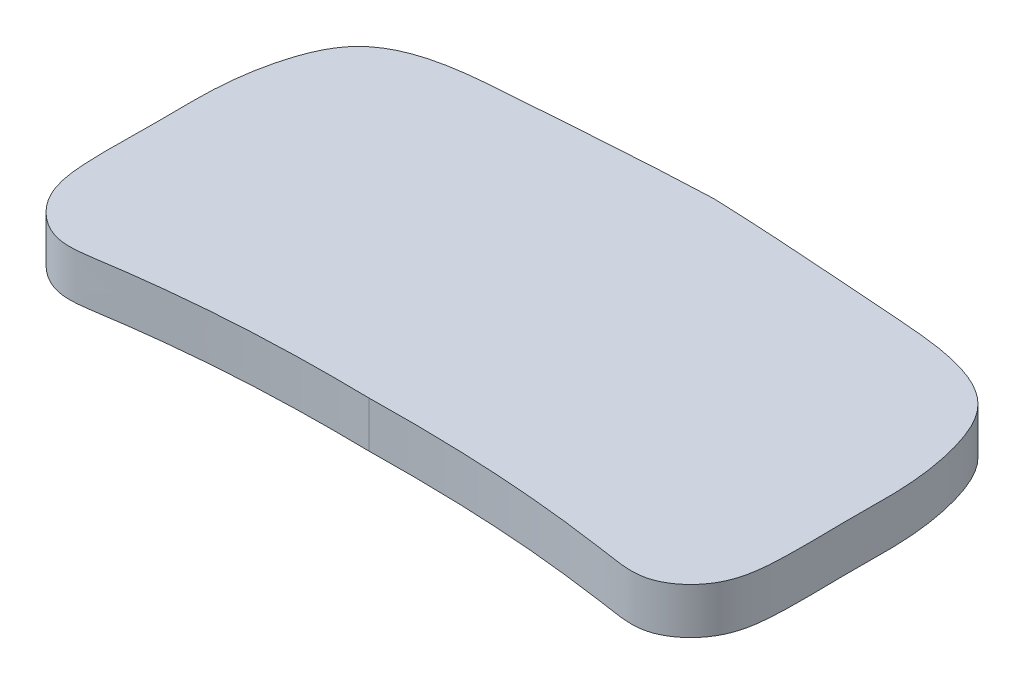
ISO-10303-21;
HEADER;
FILE_DESCRIPTION(('STEP AP214'),'2;1');
FILE_NAME('part.step','',(''),(''),'','','');
FILE_SCHEMA(('AUTOMOTIVE_DESIGN { 1 0 10303 214 1 1 1 1 }'));
ENDSEC;
DATA;
#1=APPLICATION_CONTEXT('core data for automotive mechanical design processes');
#2=APPLICATION_PROTOCOL_DEFINITION('international standard','automotive_design',2000,#1);
#3=PRODUCT_CONTEXT('',#1,'mechanical');
#4=PRODUCT('Part','Part','',(#3));
#5=PRODUCT_RELATED_PRODUCT_CATEGORY('part','',(#4));
#6=PRODUCT_DEFINITION_FORMATION('','',#4);
#7=PRODUCT_DEFINITION_CONTEXT('part definition',#1,'design');
#8=PRODUCT_DEFINITION('design','',#6,#7);
#9=PRODUCT_DEFINITION_SHAPE('','',#8);
#10=(LENGTH_UNIT() NAMED_UNIT(*) SI_UNIT(.MILLI.,.METRE.));
#11=(NAMED_UNIT(*) PLANE_ANGLE_UNIT() SI_UNIT($,.RADIAN.));
#12=(NAMED_UNIT(*) SI_UNIT($,.STERADIAN.) SOLID_ANGLE_UNIT());
#13=UNCERTAINTY_MEASURE_WITH_UNIT(LENGTH_MEASURE(1.E-05),#10,'distance_accuracy_value','');
#14=(GEOMETRIC_REPRESENTATION_CONTEXT(3) GLOBAL_UNCERTAINTY_ASSIGNED_CONTEXT((#13)) GLOBAL_UNIT_ASSIGNED_CONTEXT((#10,
#11,#12)) REPRESENTATION_CONTEXT('',''));
#15=CARTESIAN_POINT('',(0.,0.,0.));
#16=DIRECTION('',(0.,0.,1.));
#17=DIRECTION('',(1.,0.,0.));
#18=AXIS2_PLACEMENT_3D('',#15,#16,#17);
#19=CARTESIAN_POINT('',(0.,4.,12.0711586915417));
#20=CARTESIAN_POINT('',(7.80722657595746,4.,11.9388791018897));
#21=CARTESIAN_POINT('',(15.7201314042807,4.,12.3493127279278));
#22=CARTESIAN_POINT('',(26.0311745833425,4.,14.0817505540502));
#23=CARTESIAN_POINT('',(29.6371828286956,4.,10.9287665933557));
#24=CARTESIAN_POINT('',(30.1549278508663,4.,5.70169142307951));
#25=CARTESIAN_POINT('',(29.9406933071393,4.,0.887353995512586));
#26=CARTESIAN_POINT('',(30.0904697170656,4.,-4.33609871158164));
#27=CARTESIAN_POINT('',(29.550286899474,4.,-8.92925037055667));
#28=CARTESIAN_POINT('',(26.8757166498351,4.,-16.1960144953641));
#29=CARTESIAN_POINT('',(13.9033574872135,4.,-17.0425876368378));
#30=CARTESIAN_POINT('',(5.82021209508084,4.,-17.7095362441117));
#31=CARTESIAN_POINT('',(0.,4.,-17.9288413084583));
#32=B_SPLINE_CURVE_WITH_KNOTS('',3,(#19,#20,#21,#22,#23,#24,#25,#26,#27,#28,#29,#30,#31),
.UNSPECIFIED.,.F.,.F.,(4,1,1,1,1,1,1,1,1,1,4),(0.,0.268119341177124,0.309991094049163,
0.3640671280651,0.4172491624366,0.494623043419222,0.540270268501581,0.605523361226878,
0.663987204348086,0.801540498685919,1.),.UNSPECIFIED.);
#33=DIRECTION('',(0.,-1.,0.));
#34=VECTOR('',#33,1.);
#35=SURFACE_OF_LINEAR_EXTRUSION('',#32,#34);
#36=CARTESIAN_POINT('',(0.,0.,12.0711586915417));
#37=CARTESIAN_POINT('',(7.80722657595746,0.,11.9388791018897));
#38=CARTESIAN_POINT('',(15.7201314042807,0.,12.3493127279278));
#39=CARTESIAN_POINT('',(26.0311745833425,0.,14.0817505540502));
#40=CARTESIAN_POINT('',(29.6371828286956,0.,10.9287665933557));
#41=CARTESIAN_POINT('',(30.1549278508663,0.,5.70169142307951));
#42=CARTESIAN_POINT('',(29.9406933071393,0.,0.887353995512586));
#43=CARTESIAN_POINT('',(30.0904697170656,0.,-4.33609871158164));
#44=CARTESIAN_POINT('',(29.550286899474,0.,-8.92925037055667));
#45=CARTESIAN_POINT('',(26.8757166498351,0.,-16.1960144953641));
#46=CARTESIAN_POINT('',(13.9033574872135,0.,-17.0425876368378));
#47=CARTESIAN_POINT('',(5.82021209508084,0.,-17.7095362441117));
#48=CARTESIAN_POINT('',(0.,0.,-17.9288413084583));
#49=B_SPLINE_CURVE_WITH_KNOTS('',3,(#36,#37,#38,#39,#40,#41,#42,#43,#44,#45,#46,#47,#48),
.UNSPECIFIED.,.F.,.F.,(4,1,1,1,1,1,1,1,1,1,4),(0.,0.268119341177124,0.309991094049163,
0.3640671280651,0.4172491624366,0.494623043419222,0.540270268501581,0.605523361226878,
0.663987204348086,0.801540498685919,1.),.UNSPECIFIED.);
#50=CARTESIAN_POINT('',(0.,0.,12.0711586915417));
#51=VERTEX_POINT('',#50);
#52=CARTESIAN_POINT('',(0.,0.,-17.9288413084583));
#53=VERTEX_POINT('',#52);
#54=EDGE_CURVE('E67',#51,#53,#49,.T.);
#55=ORIENTED_EDGE('',*,*,#54,.T.);
#56=DIRECTION('',(0.,-1.,0.));
#57=VECTOR('',#56,1.);
#58=CARTESIAN_POINT('',(0.,4.,-17.9288413084583));
#59=LINE('',#58,#57);
#60=CARTESIAN_POINT('',(0.,4.,-17.9288413084583));
#61=VERTEX_POINT('',#60);
#62=EDGE_CURVE('E11',#61,#53,#59,.T.);
#63=ORIENTED_EDGE('',*,*,#62,.F.);
#64=CARTESIAN_POINT('',(0.,4.,12.0711586915417));
#65=VERTEX_POINT('',#64);
#66=EDGE_CURVE('E66',#65,#61,#32,.T.);
#67=ORIENTED_EDGE('',*,*,#66,.F.);
#68=DIRECTION('',(0.,-1.,0.));
#69=VECTOR('',#68,1.);
#70=CARTESIAN_POINT('',(0.,4.,12.0711586915417));
#71=LINE('',#70,#69);
#72=EDGE_CURVE('E44',#65,#51,#71,.T.);
#73=ORIENTED_EDGE('',*,*,#72,.T.);
#74=EDGE_LOOP('',(#55,#63,#67,#73));
#75=FACE_BOUND('',#74,.T.);
#76=ADVANCED_FACE('F35',(#75),#35,.F.);
#77=CARTESIAN_POINT('',(0.,4.,-17.9288413084583));
#78=CARTESIAN_POINT('',(-5.82021209508084,4.,-17.7095362441117));
#79=CARTESIAN_POINT('',(-13.9033574872135,4.,-17.0425876368378));
#80=CARTESIAN_POINT('',(-26.8757166498351,4.,-16.196014495364));
#81=CARTESIAN_POINT('',(-29.550286899474,4.,-8.92925037055667));
#82=CARTESIAN_POINT('',(-30.0904697170656,4.,-4.33609871158164));
#83=CARTESIAN_POINT('',(-29.9406933071393,4.,0.887353995512594));
#84=CARTESIAN_POINT('',(-30.1549278508663,4.,5.70169142307952));
#85=CARTESIAN_POINT('',(-29.6371828286956,4.,10.9287665933557));
#86=CARTESIAN_POINT('',(-26.0311745833425,4.,14.0817505540502));
#87=CARTESIAN_POINT('',(-15.7201314042807,4.,12.3493127279278));
#88=CARTESIAN_POINT('',(-7.80722657595746,4.,11.9388791018897));
#89=CARTESIAN_POINT('',(0.,4.,12.0711586915417));
#90=B_SPLINE_CURVE_WITH_KNOTS('',3,(#77,#78,#79,#80,#81,#82,#83,#84,#85,#86,#87,#88,#89),
.UNSPECIFIED.,.F.,.F.,(4,1,1,1,1,1,1,1,1,1,4),(0.,0.198459501314081,0.336012795651914,
0.394476638773122,0.459729731498419,0.505376956580778,0.5827508375634,0.6359328719349,
0.690008905950837,0.731880658822876,1.),.UNSPECIFIED.);
#91=DIRECTION('',(0.,-1.,0.));
#92=VECTOR('',#91,1.);
#93=SURFACE_OF_LINEAR_EXTRUSION('',#90,#92);
#94=CARTESIAN_POINT('',(0.,0.,-17.9288413084583));
#95=CARTESIAN_POINT('',(-5.82021209508084,0.,-17.7095362441117));
#96=CARTESIAN_POINT('',(-13.9033574872135,0.,-17.0425876368378));
#97=CARTESIAN_POINT('',(-26.8757166498351,0.,-16.196014495364));
#98=CARTESIAN_POINT('',(-29.550286899474,0.,-8.92925037055667));
#99=CARTESIAN_POINT('',(-30.0904697170656,0.,-4.33609871158164));
#100=CARTESIAN_POINT('',(-29.9406933071393,0.,0.887353995512594));
#101=CARTESIAN_POINT('',(-30.1549278508663,0.,5.70169142307952));
#102=CARTESIAN_POINT('',(-29.6371828286956,0.,10.9287665933557));
#103=CARTESIAN_POINT('',(-26.0311745833425,0.,14.0817505540502));
#104=CARTESIAN_POINT('',(-15.7201314042807,0.,12.3493127279278));
#105=CARTESIAN_POINT('',(-7.80722657595746,0.,11.9388791018897));
#106=CARTESIAN_POINT('',(0.,0.,12.0711586915417));
#107=B_SPLINE_CURVE_WITH_KNOTS('',3,(#94,#95,#96,#97,#98,#99,#100,#101,#102,#103,#104,#105,
#106),.UNSPECIFIED.,.F.,.F.,(4,1,1,1,1,1,1,1,1,1,4),(0.,0.198459501314081,0.336012795651914,
0.394476638773122,0.459729731498419,0.505376956580778,0.5827508375634,0.6359328719349,
0.690008905950837,0.731880658822876,1.),.UNSPECIFIED.);
#108=EDGE_CURVE('E59',#53,#51,#107,.T.);
#109=ORIENTED_EDGE('',*,*,#108,.T.);
#110=ORIENTED_EDGE('',*,*,#72,.F.);
#111=EDGE_CURVE('E51',#61,#65,#90,.T.);
#112=ORIENTED_EDGE('',*,*,#111,.F.);
#113=ORIENTED_EDGE('',*,*,#62,.T.);
#114=EDGE_LOOP('',(#109,#110,#112,#113));
#115=FACE_BOUND('',#114,.T.);
#116=ADVANCED_FACE('F62',(#115),#93,.F.);
#117=CARTESIAN_POINT('',(30.0020337285879,4.,-0.445277639874697));
#118=DIRECTION('',(0.,1.,0.));
#119=DIRECTION('',(0.,0.,1.));
#120=AXIS2_PLACEMENT_3D('',#117,#118,#119);
#121=PLANE('',#120);
#122=ORIENTED_EDGE('',*,*,#66,.T.);
#123=ORIENTED_EDGE('',*,*,#111,.T.);
#124=EDGE_LOOP('',(#122,#123));
#125=FACE_BOUND('',#124,.T.);
#126=ADVANCED_FACE('F94',(#125),#121,.T.);
#127=CARTESIAN_POINT('',(30.0020337285879,0.,-0.445277639874697));
#128=DIRECTION('',(0.,1.,0.));
#129=DIRECTION('',(0.,0.,1.));
#130=AXIS2_PLACEMENT_3D('',#127,#128,#129);
#131=PLANE('',#130);
#132=ORIENTED_EDGE('',*,*,#54,.F.);
#133=ORIENTED_EDGE('',*,*,#108,.F.);
#134=EDGE_LOOP('',(#132,#133));
#135=FACE_BOUND('',#134,.T.);
#136=ADVANCED_FACE('F70',(#135),#131,.F.);
#137=CLOSED_SHELL('',(#76,#116,#126,#136));
#138=MANIFOLD_SOLID_BREP('B2',#137);
#139=ADVANCED_BREP_SHAPE_REPRESENTATION('',(#18,#138),#14);
#140=SHAPE_DEFINITION_REPRESENTATION(#9,#139);
ENDSEC;
END-ISO-10303-21;
